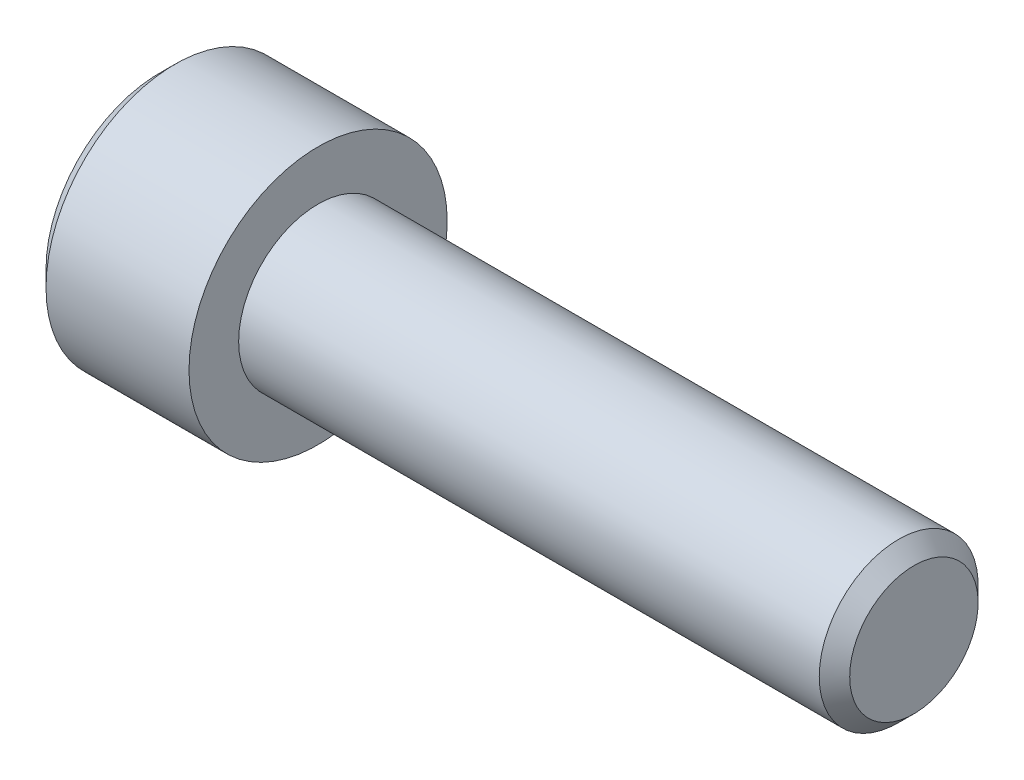
ISO-10303-21;
HEADER;
FILE_DESCRIPTION(('STEP AP214'),'2;1');
FILE_NAME('part.step','',(''),(''),'','','');
FILE_SCHEMA(('AUTOMOTIVE_DESIGN { 1 0 10303 214 1 1 1 1 }'));
ENDSEC;
DATA;
#1=APPLICATION_CONTEXT('core data for automotive mechanical design processes');
#2=APPLICATION_PROTOCOL_DEFINITION('international standard','automotive_design',2000,#1);
#3=PRODUCT_CONTEXT('',#1,'mechanical');
#4=PRODUCT('Part','Part','',(#3));
#5=PRODUCT_RELATED_PRODUCT_CATEGORY('part','',(#4));
#6=PRODUCT_DEFINITION_FORMATION('','',#4);
#7=PRODUCT_DEFINITION_CONTEXT('part definition',#1,'design');
#8=PRODUCT_DEFINITION('design','',#6,#7);
#9=PRODUCT_DEFINITION_SHAPE('','',#8);
#10=(LENGTH_UNIT() NAMED_UNIT(*) SI_UNIT(.MILLI.,.METRE.));
#11=(NAMED_UNIT(*) PLANE_ANGLE_UNIT() SI_UNIT($,.RADIAN.));
#12=(NAMED_UNIT(*) SI_UNIT($,.STERADIAN.) SOLID_ANGLE_UNIT());
#13=UNCERTAINTY_MEASURE_WITH_UNIT(LENGTH_MEASURE(1.E-05),#10,'distance_accuracy_value','');
#14=(GEOMETRIC_REPRESENTATION_CONTEXT(3) GLOBAL_UNCERTAINTY_ASSIGNED_CONTEXT((#13)) GLOBAL_UNIT_ASSIGNED_CONTEXT((#10,
#11,#12)) REPRESENTATION_CONTEXT('',''));
#15=CARTESIAN_POINT('',(0.,0.,0.));
#16=DIRECTION('',(0.,0.,1.));
#17=DIRECTION('',(1.,0.,0.));
#18=AXIS2_PLACEMENT_3D('',#15,#16,#17);
#19=CARTESIAN_POINT('',(-4.,0.,0.));
#20=DIRECTION('',(1.,0.,0.));
#21=DIRECTION('',(0.,0.,-1.));
#22=AXIS2_PLACEMENT_3D('',#19,#20,#21);
#23=PLANE('',#22);
#24=DIRECTION('',(0.,1.,0.));
#25=VECTOR('',#24,1.);
#26=CARTESIAN_POINT('',(-4.,0.,3.));
#27=LINE('',#26,#25);
#28=CARTESIAN_POINT('',(-4.,1.73205080756888,3.));
#29=VERTEX_POINT('',#28);
#30=CARTESIAN_POINT('',(-3.99999999999534,0.,2.99999999999295));
#31=VERTEX_POINT('',#30);
#32=EDGE_CURVE('E109',#29,#31,#27,.F.);
#33=ORIENTED_EDGE('',*,*,#32,.F.);
#34=DIRECTION('',(0.,-0.500000000000001,0.866025403784438));
#35=VECTOR('',#34,1.);
#36=CARTESIAN_POINT('',(-4.,2.59807621135332,1.5));
#37=LINE('',#36,#35);
#38=CARTESIAN_POINT('',(-3.99999999999534,2.59807621134721,1.49999999999647));
#39=VERTEX_POINT('',#38);
#40=EDGE_CURVE('E93',#39,#29,#37,.T.);
#41=ORIENTED_EDGE('',*,*,#40,.F.);
#42=CARTESIAN_POINT('',(-3.99999999999068,0.,0.));
#43=DIRECTION('',(-1.,0.,0.));
#44=DIRECTION('',(0.,0.,1.));
#45=AXIS2_PLACEMENT_3D('',#42,#43,#44);
#46=CIRCLE('',#45,2.9999999999859);
#47=EDGE_CURVE('E20',#39,#31,#46,.F.);
#48=ORIENTED_EDGE('',*,*,#47,.T.);
#49=EDGE_LOOP('',(#33,#41,#48));
#50=FACE_BOUND('',#49,.T.);
#51=ADVANCED_FACE('F17',(#50),#23,.F.);
#52=CARTESIAN_POINT('',(-4.,0.,0.));
#53=DIRECTION('',(1.,0.,0.));
#54=DIRECTION('',(0.,0.,-1.));
#55=AXIS2_PLACEMENT_3D('',#52,#53,#54);
#56=PLANE('',#55);
#57=DIRECTION('',(0.,0.499999999999996,-0.866025403784441));
#58=VECTOR('',#57,1.);
#59=CARTESIAN_POINT('',(-4.,-3.46410161513775,0.));
#60=LINE('',#59,#58);
#61=CARTESIAN_POINT('',(-4.,-3.46410161513775,0.));
#62=VERTEX_POINT('',#61);
#63=CARTESIAN_POINT('',(-3.99999999999534,-2.59807621134721,-1.49999999999648));
#64=VERTEX_POINT('',#63);
#65=EDGE_CURVE('E149',#62,#64,#60,.T.);
#66=ORIENTED_EDGE('',*,*,#65,.F.);
#67=DIRECTION('',(0.,-0.499999999999996,-0.866025403784441));
#68=VECTOR('',#67,1.);
#69=CARTESIAN_POINT('',(-4.,-2.59807621135332,1.5));
#70=LINE('',#69,#68);
#71=CARTESIAN_POINT('',(-3.99999999999534,-2.59807621134721,1.49999999999647));
#72=VERTEX_POINT('',#71);
#73=EDGE_CURVE('E153',#72,#62,#70,.T.);
#74=ORIENTED_EDGE('',*,*,#73,.F.);
#75=CARTESIAN_POINT('',(-3.99999999999068,0.,0.));
#76=DIRECTION('',(-1.,0.,0.));
#77=DIRECTION('',(0.,0.,1.));
#78=AXIS2_PLACEMENT_3D('',#75,#76,#77);
#79=CIRCLE('',#78,2.9999999999859);
#80=EDGE_CURVE('E123',#72,#64,#79,.F.);
#81=ORIENTED_EDGE('',*,*,#80,.T.);
#82=EDGE_LOOP('',(#66,#74,#81));
#83=FACE_BOUND('',#82,.T.);
#84=ADVANCED_FACE('F420',(#83),#56,.F.);
#85=CARTESIAN_POINT('',(-4.,0.,0.));
#86=DIRECTION('',(1.,0.,0.));
#87=DIRECTION('',(0.,0.,-1.));
#88=AXIS2_PLACEMENT_3D('',#85,#86,#87);
#89=PLANE('',#88);
#90=DIRECTION('',(0.,1.,0.));
#91=VECTOR('',#90,1.);
#92=CARTESIAN_POINT('',(-4.,0.,-3.));
#93=LINE('',#92,#91);
#94=CARTESIAN_POINT('',(-4.,-1.73205080756888,-3.));
#95=VERTEX_POINT('',#94);
#96=CARTESIAN_POINT('',(-3.99999999999534,0.,-2.99999999999295));
#97=VERTEX_POINT('',#96);
#98=EDGE_CURVE('E141',#95,#97,#93,.T.);
#99=ORIENTED_EDGE('',*,*,#98,.F.);
#100=DIRECTION('',(0.,0.500000000000001,-0.866025403784438));
#101=VECTOR('',#100,1.);
#102=CARTESIAN_POINT('',(-4.,-2.59807621135332,-1.5));
#103=LINE('',#102,#101);
#104=EDGE_CURVE('E145',#64,#95,#103,.T.);
#105=ORIENTED_EDGE('',*,*,#104,.F.);
#106=CARTESIAN_POINT('',(-3.99999999999068,0.,0.));
#107=DIRECTION('',(-1.,0.,0.));
#108=DIRECTION('',(0.,0.,1.));
#109=AXIS2_PLACEMENT_3D('',#106,#107,#108);
#110=CIRCLE('',#109,2.9999999999859);
#111=EDGE_CURVE('E125',#64,#97,#110,.F.);
#112=ORIENTED_EDGE('',*,*,#111,.T.);
#113=EDGE_LOOP('',(#99,#105,#112));
#114=FACE_BOUND('',#113,.T.);
#115=ADVANCED_FACE('F207',(#114),#89,.F.);
#116=CARTESIAN_POINT('',(-4.,0.,0.));
#117=DIRECTION('',(1.,0.,0.));
#118=DIRECTION('',(0.,0.,-1.));
#119=AXIS2_PLACEMENT_3D('',#116,#117,#118);
#120=PLANE('',#119);
#121=DIRECTION('',(0.,0.500000000000001,0.866025403784438));
#122=VECTOR('',#121,1.);
#123=CARTESIAN_POINT('',(-4.,1.73205080756888,-3.));
#124=LINE('',#123,#122);
#125=CARTESIAN_POINT('',(-4.,1.73205080756888,-3.));
#126=VERTEX_POINT('',#125);
#127=CARTESIAN_POINT('',(-3.99999999999534,2.59807621134721,-1.49999999999647));
#128=VERTEX_POINT('',#127);
#129=EDGE_CURVE('E101',#126,#128,#124,.T.);
#130=ORIENTED_EDGE('',*,*,#129,.F.);
#131=DIRECTION('',(0.,1.,0.));
#132=VECTOR('',#131,1.);
#133=CARTESIAN_POINT('',(-4.,0.,-3.));
#134=LINE('',#133,#132);
#135=EDGE_CURVE('E137',#97,#126,#134,.T.);
#136=ORIENTED_EDGE('',*,*,#135,.F.);
#137=CARTESIAN_POINT('',(-3.99999999999068,0.,0.));
#138=DIRECTION('',(-1.,0.,0.));
#139=DIRECTION('',(0.,0.,1.));
#140=AXIS2_PLACEMENT_3D('',#137,#138,#139);
#141=CIRCLE('',#140,2.9999999999859);
#142=EDGE_CURVE('E117',#97,#128,#141,.F.);
#143=ORIENTED_EDGE('',*,*,#142,.T.);
#144=EDGE_LOOP('',(#130,#136,#143));
#145=FACE_BOUND('',#144,.T.);
#146=ADVANCED_FACE('F210',(#145),#120,.F.);
#147=CARTESIAN_POINT('',(-4.,0.,0.));
#148=DIRECTION('',(1.,0.,0.));
#149=DIRECTION('',(0.,0.,-1.));
#150=AXIS2_PLACEMENT_3D('',#147,#148,#149);
#151=PLANE('',#150);
#152=CARTESIAN_POINT('',(-3.99999999999068,0.,0.));
#153=DIRECTION('',(-1.,0.,0.));
#154=DIRECTION('',(0.,0.,1.));
#155=AXIS2_PLACEMENT_3D('',#152,#153,#154);
#156=CIRCLE('',#155,2.9999999999859);
#157=EDGE_CURVE('E112',#128,#39,#156,.F.);
#158=ORIENTED_EDGE('',*,*,#157,.T.);
#159=DIRECTION('',(0.,-0.499999999999996,0.866025403784441));
#160=VECTOR('',#159,1.);
#161=CARTESIAN_POINT('',(-4.,3.46410161513775,0.));
#162=LINE('',#161,#160);
#163=CARTESIAN_POINT('',(-4.,3.46410161513775,0.));
#164=VERTEX_POINT('',#163);
#165=EDGE_CURVE('E89',#164,#39,#162,.T.);
#166=ORIENTED_EDGE('',*,*,#165,.F.);
#167=DIRECTION('',(0.,0.499999999999996,0.866025403784441));
#168=VECTOR('',#167,1.);
#169=CARTESIAN_POINT('',(-4.,2.59807621135332,-1.5));
#170=LINE('',#169,#168);
#171=EDGE_CURVE('E100',#128,#164,#170,.T.);
#172=ORIENTED_EDGE('',*,*,#171,.F.);
#173=EDGE_LOOP('',(#158,#166,#172));
#174=FACE_BOUND('',#173,.T.);
#175=ADVANCED_FACE('F113',(#174),#151,.F.);
#176=CARTESIAN_POINT('',(-3.99999999999068,0.,0.));
#177=DIRECTION('',(-1.,0.,0.));
#178=DIRECTION('',(0.,0.,1.));
#179=AXIS2_PLACEMENT_3D('',#176,#177,#178);
#180=CONICAL_SURFACE('',#179,2.9999999999859,1.30899693900041);
#181=CARTESIAN_POINT('',(-3.1961524227313,0.,5.6843418860808E-11));
#182=VERTEX_POINT('',#181);
#183=VERTEX_LOOP('',#182);
#184=FACE_BOUND('',#183,.T.);
#185=ORIENTED_EDGE('',*,*,#142,.F.);
#186=ORIENTED_EDGE('',*,*,#111,.F.);
#187=ORIENTED_EDGE('',*,*,#80,.F.);
#188=CARTESIAN_POINT('',(-3.99999999999068,0.,0.));
#189=DIRECTION('',(-1.,0.,0.));
#190=DIRECTION('',(0.,0.,1.));
#191=AXIS2_PLACEMENT_3D('',#188,#189,#190);
#192=CIRCLE('',#191,2.9999999999859);
#193=EDGE_CURVE('E116',#72,#31,#192,.T.);
#194=ORIENTED_EDGE('',*,*,#193,.T.);
#195=ORIENTED_EDGE('',*,*,#47,.F.);
#196=ORIENTED_EDGE('',*,*,#157,.F.);
#197=EDGE_LOOP('',(#185,#186,#187,#194,#195,#196));
#198=FACE_BOUND('',#197,.T.);
#199=ADVANCED_FACE('F119',(#184,#198),#180,.F.);
#200=CARTESIAN_POINT('',(-4.,0.,0.));
#201=DIRECTION('',(1.,0.,0.));
#202=DIRECTION('',(0.,0.,-1.));
#203=AXIS2_PLACEMENT_3D('',#200,#201,#202);
#204=PLANE('',#203);
#205=DIRECTION('',(0.,0.5,0.866025403784439));
#206=VECTOR('',#205,1.);
#207=CARTESIAN_POINT('',(-4.,-1.73205080756888,3.));
#208=LINE('',#207,#206);
#209=CARTESIAN_POINT('',(-4.,-1.73205080756888,3.));
#210=VERTEX_POINT('',#209);
#211=EDGE_CURVE('E197',#210,#72,#208,.F.);
#212=ORIENTED_EDGE('',*,*,#211,.F.);
#213=DIRECTION('',(0.,1.,0.));
#214=VECTOR('',#213,1.);
#215=CARTESIAN_POINT('',(-4.,1.73205080756888,3.));
#216=LINE('',#215,#214);
#217=EDGE_CURVE('E227',#31,#210,#216,.F.);
#218=ORIENTED_EDGE('',*,*,#217,.F.);
#219=ORIENTED_EDGE('',*,*,#193,.F.);
#220=EDGE_LOOP('',(#212,#218,#219));
#221=FACE_BOUND('',#220,.T.);
#222=ADVANCED_FACE('F240',(#221),#204,.F.);
#223=CARTESIAN_POINT('',(-4.,-1.73205080756888,3.));
#224=DIRECTION('',(0.,0.866025403784439,-0.5));
#225=DIRECTION('',(0.,0.5,0.866025403784439));
#226=AXIS2_PLACEMENT_3D('',#223,#224,#225);
#227=PLANE('',#226);
#228=ORIENTED_EDGE('',*,*,#73,.T.);
#229=DIRECTION('',(1.,0.,0.));
#230=VECTOR('',#229,1.);
#231=CARTESIAN_POINT('',(-4.,-3.46410161513775,0.));
#232=LINE('',#231,#230);
#233=CARTESIAN_POINT('',(-8.,-3.46410161513775,0.));
#234=VERTEX_POINT('',#233);
#235=EDGE_CURVE('E170',#234,#62,#232,.T.);
#236=ORIENTED_EDGE('',*,*,#235,.F.);
#237=DIRECTION('',(0.,0.499999999999998,0.86602540378444));
#238=VECTOR('',#237,1.);
#239=CARTESIAN_POINT('',(-8.,-3.46410161513775,0.));
#240=LINE('',#239,#238);
#241=CARTESIAN_POINT('',(-8.,-1.73205080756888,3.));
#242=VERTEX_POINT('',#241);
#243=EDGE_CURVE('E175',#234,#242,#240,.T.);
#244=ORIENTED_EDGE('',*,*,#243,.T.);
#245=DIRECTION('',(-1.,0.,0.));
#246=VECTOR('',#245,1.);
#247=CARTESIAN_POINT('',(-4.,-1.73205080756888,3.));
#248=LINE('',#247,#246);
#249=EDGE_CURVE('E183',#210,#242,#248,.T.);
#250=ORIENTED_EDGE('',*,*,#249,.F.);
#251=ORIENTED_EDGE('',*,*,#211,.T.);
#252=EDGE_LOOP('',(#228,#236,#244,#250,#251));
#253=FACE_BOUND('',#252,.T.);
#254=ADVANCED_FACE('F238',(#253),#227,.T.);
#255=CARTESIAN_POINT('',(-4.,1.73205080756888,3.));
#256=DIRECTION('',(0.,0.,-1.));
#257=DIRECTION('',(-1.,0.,0.));
#258=AXIS2_PLACEMENT_3D('',#255,#256,#257);
#259=PLANE('',#258);
#260=ORIENTED_EDGE('',*,*,#217,.T.);
#261=ORIENTED_EDGE('',*,*,#249,.T.);
#262=DIRECTION('',(0.,1.,0.));
#263=VECTOR('',#262,1.);
#264=CARTESIAN_POINT('',(-8.,0.,3.));
#265=LINE('',#264,#263);
#266=CARTESIAN_POINT('',(-8.,1.73205080756888,3.));
#267=VERTEX_POINT('',#266);
#268=EDGE_CURVE('E221',#242,#267,#265,.T.);
#269=ORIENTED_EDGE('',*,*,#268,.T.);
#270=DIRECTION('',(1.,0.,0.));
#271=VECTOR('',#270,1.);
#272=CARTESIAN_POINT('',(-4.,1.73205080756887,3.));
#273=LINE('',#272,#271);
#274=EDGE_CURVE('E166',#29,#267,#273,.F.);
#275=ORIENTED_EDGE('',*,*,#274,.F.);
#276=ORIENTED_EDGE('',*,*,#32,.T.);
#277=EDGE_LOOP('',(#260,#261,#269,#275,#276));
#278=FACE_BOUND('',#277,.T.);
#279=ADVANCED_FACE('F242',(#278),#259,.T.);
#280=CARTESIAN_POINT('',(-4.,3.46410161513775,0.));
#281=DIRECTION('',(0.,-0.866025403784439,-0.5));
#282=DIRECTION('',(0.,0.5,-0.866025403784439));
#283=AXIS2_PLACEMENT_3D('',#280,#281,#282);
#284=PLANE('',#283);
#285=ORIENTED_EDGE('',*,*,#40,.T.);
#286=ORIENTED_EDGE('',*,*,#274,.T.);
#287=DIRECTION('',(0.,0.499999999999998,-0.86602540378444));
#288=VECTOR('',#287,1.);
#289=CARTESIAN_POINT('',(-8.,1.73205080756888,3.));
#290=LINE('',#289,#288);
#291=CARTESIAN_POINT('',(-8.,3.46410161513775,0.));
#292=VERTEX_POINT('',#291);
#293=EDGE_CURVE('E218',#267,#292,#290,.T.);
#294=ORIENTED_EDGE('',*,*,#293,.T.);
#295=DIRECTION('',(1.,0.,0.));
#296=VECTOR('',#295,1.);
#297=CARTESIAN_POINT('',(-4.,3.46410161513776,0.));
#298=LINE('',#297,#296);
#299=EDGE_CURVE('E96',#164,#292,#298,.F.);
#300=ORIENTED_EDGE('',*,*,#299,.F.);
#301=ORIENTED_EDGE('',*,*,#165,.T.);
#302=EDGE_LOOP('',(#285,#286,#294,#300,#301));
#303=FACE_BOUND('',#302,.T.);
#304=ADVANCED_FACE('F91',(#303),#284,.T.);
#305=CARTESIAN_POINT('',(-4.,1.73205080756888,-3.));
#306=DIRECTION('',(0.,-0.866025403784439,0.5));
#307=DIRECTION('',(0.,-0.5,-0.866025403784439));
#308=AXIS2_PLACEMENT_3D('',#305,#306,#307);
#309=PLANE('',#308);
#310=ORIENTED_EDGE('',*,*,#171,.T.);
#311=ORIENTED_EDGE('',*,*,#299,.T.);
#312=DIRECTION('',(0.,-0.499999999999998,-0.86602540378444));
#313=VECTOR('',#312,1.);
#314=CARTESIAN_POINT('',(-8.,3.46410161513775,0.));
#315=LINE('',#314,#313);
#316=CARTESIAN_POINT('',(-8.,1.73205080756888,-3.));
#317=VERTEX_POINT('',#316);
#318=EDGE_CURVE('E215',#292,#317,#315,.T.);
#319=ORIENTED_EDGE('',*,*,#318,.T.);
#320=DIRECTION('',(1.,0.,0.));
#321=VECTOR('',#320,1.);
#322=CARTESIAN_POINT('',(-4.,1.73205080756888,-3.));
#323=LINE('',#322,#321);
#324=EDGE_CURVE('E165',#126,#317,#323,.F.);
#325=ORIENTED_EDGE('',*,*,#324,.F.);
#326=ORIENTED_EDGE('',*,*,#129,.T.);
#327=EDGE_LOOP('',(#310,#311,#319,#325,#326));
#328=FACE_BOUND('',#327,.T.);
#329=ADVANCED_FACE('F213',(#328),#309,.T.);
#330=CARTESIAN_POINT('',(-4.,-1.73205080756888,-3.));
#331=DIRECTION('',(0.,0.,1.));
#332=DIRECTION('',(1.,0.,0.));
#333=AXIS2_PLACEMENT_3D('',#330,#331,#332);
#334=PLANE('',#333);
#335=ORIENTED_EDGE('',*,*,#135,.T.);
#336=ORIENTED_EDGE('',*,*,#324,.T.);
#337=DIRECTION('',(0.,1.,0.));
#338=VECTOR('',#337,1.);
#339=CARTESIAN_POINT('',(-8.,0.,-3.));
#340=LINE('',#339,#338);
#341=CARTESIAN_POINT('',(-8.,-1.73205080756888,-3.));
#342=VERTEX_POINT('',#341);
#343=EDGE_CURVE('E35',#317,#342,#340,.F.);
#344=ORIENTED_EDGE('',*,*,#343,.T.);
#345=DIRECTION('',(1.,0.,0.));
#346=VECTOR('',#345,1.);
#347=CARTESIAN_POINT('',(-4.,-1.73205080756887,-3.));
#348=LINE('',#347,#346);
#349=EDGE_CURVE('E173',#95,#342,#348,.F.);
#350=ORIENTED_EDGE('',*,*,#349,.F.);
#351=ORIENTED_EDGE('',*,*,#98,.T.);
#352=EDGE_LOOP('',(#335,#336,#344,#350,#351));
#353=FACE_BOUND('',#352,.T.);
#354=ADVANCED_FACE('F212',(#353),#334,.T.);
#355=CARTESIAN_POINT('',(-4.,-3.46410161513775,0.));
#356=DIRECTION('',(0.,0.866025403784439,0.5));
#357=DIRECTION('',(0.,-0.5,0.866025403784439));
#358=AXIS2_PLACEMENT_3D('',#355,#356,#357);
#359=PLANE('',#358);
#360=ORIENTED_EDGE('',*,*,#104,.T.);
#361=ORIENTED_EDGE('',*,*,#349,.T.);
#362=DIRECTION('',(0.,-0.499999999999998,0.86602540378444));
#363=VECTOR('',#362,1.);
#364=CARTESIAN_POINT('',(-8.,-1.73205080756888,-3.));
#365=LINE('',#364,#363);
#366=EDGE_CURVE('E196',#342,#234,#365,.T.);
#367=ORIENTED_EDGE('',*,*,#366,.T.);
#368=ORIENTED_EDGE('',*,*,#235,.T.);
#369=ORIENTED_EDGE('',*,*,#65,.T.);
#370=EDGE_LOOP('',(#360,#361,#367,#368,#369));
#371=FACE_BOUND('',#370,.T.);
#372=ADVANCED_FACE('F251',(#371),#359,.T.);
#373=CARTESIAN_POINT('',(-8.,0.,0.));
#374=DIRECTION('',(1.,0.,0.));
#375=DIRECTION('',(0.,0.,-1.));
#376=AXIS2_PLACEMENT_3D('',#373,#374,#375);
#377=PLANE('',#376);
#378=ORIENTED_EDGE('',*,*,#343,.F.);
#379=ORIENTED_EDGE('',*,*,#318,.F.);
#380=ORIENTED_EDGE('',*,*,#293,.F.);
#381=ORIENTED_EDGE('',*,*,#268,.F.);
#382=ORIENTED_EDGE('',*,*,#243,.F.);
#383=ORIENTED_EDGE('',*,*,#366,.F.);
#384=EDGE_LOOP('',(#378,#379,#380,#381,#382,#383));
#385=FACE_BOUND('',#384,.T.);
#386=CARTESIAN_POINT('',(-8.0000000000382,0.,0.));
#387=DIRECTION('',(1.,0.,0.));
#388=DIRECTION('',(0.,0.,-1.));
#389=AXIS2_PLACEMENT_3D('',#386,#387,#388);
#390=CIRCLE('',#389,5.69999999993342);
#391=CARTESIAN_POINT('',(-8.0000000000382,0.,-5.69999999993342));
#392=VERTEX_POINT('',#391);
#393=EDGE_CURVE('E193',#392,#392,#390,.T.);
#394=ORIENTED_EDGE('',*,*,#393,.F.);
#395=EDGE_LOOP('',(#394));
#396=FACE_BOUND('',#395,.T.);
#397=ADVANCED_FACE('F244',(#385,#396),#377,.F.);
#398=CARTESIAN_POINT('',(-7.20000000006848,0.,0.));
#399=DIRECTION('',(1.,0.,0.));
#400=DIRECTION('',(0.,0.,-1.));
#401=AXIS2_PLACEMENT_3D('',#398,#399,#400);
#402=CONICAL_SURFACE('',#401,6.49999999990314,0.785398163397448);
#403=ORIENTED_EDGE('',*,*,#393,.T.);
#404=EDGE_LOOP('',(#403));
#405=FACE_BOUND('',#404,.T.);
#406=CARTESIAN_POINT('',(-7.2,0.,0.));
#407=DIRECTION('',(-1.,0.,0.));
#408=DIRECTION('',(0.,0.,1.));
#409=AXIS2_PLACEMENT_3D('',#406,#407,#408);
#410=CIRCLE('',#409,6.5);
#411=CARTESIAN_POINT('',(-7.2,0.,6.5));
#412=VERTEX_POINT('',#411);
#413=EDGE_CURVE('E192',#412,#412,#410,.F.);
#414=ORIENTED_EDGE('',*,*,#413,.F.);
#415=EDGE_LOOP('',(#414));
#416=FACE_BOUND('',#415,.T.);
#417=ADVANCED_FACE('F274',(#405,#416),#402,.T.);
#418=CARTESIAN_POINT('',(30.,3.233,0.));
#419=DIRECTION('',(-1.,0.,0.));
#420=DIRECTION('',(0.,0.,1.));
#421=AXIS2_PLACEMENT_3D('',#418,#419,#420);
#422=PLANE('',#421);
#423=CARTESIAN_POINT('',(29.9999999999159,0.,0.));
#424=DIRECTION('',(-1.,0.,0.));
#425=DIRECTION('',(0.,0.,1.));
#426=AXIS2_PLACEMENT_3D('',#423,#424,#425);
#427=CIRCLE('',#426,3.23299999996607);
#428=CARTESIAN_POINT('',(29.9999999999159,0.,3.23299999996607));
#429=VERTEX_POINT('',#428);
#430=EDGE_CURVE('E189',#429,#429,#427,.T.);
#431=ORIENTED_EDGE('',*,*,#430,.F.);
#432=EDGE_LOOP('',(#431));
#433=FACE_BOUND('',#432,.T.);
#434=ADVANCED_FACE('F272',(#433),#422,.F.);
#435=CARTESIAN_POINT('',(30.,0.,0.));
#436=DIRECTION('',(-1.,0.,0.));
#437=DIRECTION('',(0.,0.,1.));
#438=AXIS2_PLACEMENT_3D('',#435,#436,#437);
#439=CYLINDRICAL_SURFACE('',#438,6.5);
#440=ORIENTED_EDGE('',*,*,#413,.T.);
#441=EDGE_LOOP('',(#440));
#442=FACE_BOUND('',#441,.T.);
#443=CARTESIAN_POINT('',(0.,0.,0.));
#444=DIRECTION('',(-1.,0.,0.));
#445=DIRECTION('',(0.,0.,1.));
#446=AXIS2_PLACEMENT_3D('',#443,#444,#445);
#447=CIRCLE('',#446,6.5);
#448=CARTESIAN_POINT('',(0.,0.,6.5));
#449=VERTEX_POINT('',#448);
#450=EDGE_CURVE('E186',#449,#449,#447,.T.);
#451=ORIENTED_EDGE('',*,*,#450,.T.);
#452=EDGE_LOOP('',(#451));
#453=FACE_BOUND('',#452,.T.);
#454=ADVANCED_FACE('F268',(#442,#453),#439,.T.);
#455=CARTESIAN_POINT('',(29.2329999999765,0.,0.));
#456=DIRECTION('',(-1.,0.,0.));
#457=DIRECTION('',(0.,0.,1.));
#458=AXIS2_PLACEMENT_3D('',#455,#456,#457);
#459=CONICAL_SURFACE('',#458,3.99999999990541,0.785398163397448);
#460=CARTESIAN_POINT('',(29.233,0.,0.));
#461=DIRECTION('',(-1.,0.,0.));
#462=DIRECTION('',(0.,0.,1.));
#463=AXIS2_PLACEMENT_3D('',#460,#461,#462);
#464=CIRCLE('',#463,4.);
#465=CARTESIAN_POINT('',(29.233,0.,4.));
#466=VERTEX_POINT('',#465);
#467=EDGE_CURVE('E26',#466,#466,#464,.T.);
#468=ORIENTED_EDGE('',*,*,#467,.F.);
#469=EDGE_LOOP('',(#468));
#470=FACE_BOUND('',#469,.T.);
#471=ORIENTED_EDGE('',*,*,#430,.T.);
#472=EDGE_LOOP('',(#471));
#473=FACE_BOUND('',#472,.T.);
#474=ADVANCED_FACE('F264',(#470,#473),#459,.T.);
#475=CARTESIAN_POINT('',(0.,6.5,0.));
#476=DIRECTION('',(-1.,0.,0.));
#477=DIRECTION('',(0.,0.,1.));
#478=AXIS2_PLACEMENT_3D('',#475,#476,#477);
#479=PLANE('',#478);
#480=ORIENTED_EDGE('',*,*,#450,.F.);
#481=EDGE_LOOP('',(#480));
#482=FACE_BOUND('',#481,.T.);
#483=CARTESIAN_POINT('',(0.,0.,0.));
#484=DIRECTION('',(-1.,0.,0.));
#485=DIRECTION('',(0.,0.,1.));
#486=AXIS2_PLACEMENT_3D('',#483,#484,#485);
#487=CIRCLE('',#486,4.);
#488=CARTESIAN_POINT('',(0.,0.,4.));
#489=VERTEX_POINT('',#488);
#490=EDGE_CURVE('E11',#489,#489,#487,.F.);
#491=ORIENTED_EDGE('',*,*,#490,.F.);
#492=EDGE_LOOP('',(#491));
#493=FACE_BOUND('',#492,.T.);
#494=ADVANCED_FACE('F267',(#482,#493),#479,.F.);
#495=CARTESIAN_POINT('',(30.,0.,0.));
#496=DIRECTION('',(-1.,0.,0.));
#497=DIRECTION('',(0.,0.,1.));
#498=AXIS2_PLACEMENT_3D('',#495,#496,#497);
#499=CYLINDRICAL_SURFACE('',#498,4.);
#500=ORIENTED_EDGE('',*,*,#490,.T.);
#501=EDGE_LOOP('',(#500));
#502=FACE_BOUND('',#501,.T.);
#503=ORIENTED_EDGE('',*,*,#467,.T.);
#504=EDGE_LOOP('',(#503));
#505=FACE_BOUND('',#504,.T.);
#506=ADVANCED_FACE('F262',(#502,#505),#499,.T.);
#507=CLOSED_SHELL('',(#51,#84,#115,#146,#175,#199,#222,#254,#279,#304,#329,#354,#372,#397,#417,
#434,#454,#474,#494,#506));
#508=MANIFOLD_SOLID_BREP('B1',#507);
#509=ADVANCED_BREP_SHAPE_REPRESENTATION('',(#18,#508),#14);
#510=SHAPE_DEFINITION_REPRESENTATION(#9,#509);
ENDSEC;
END-ISO-10303-21;
